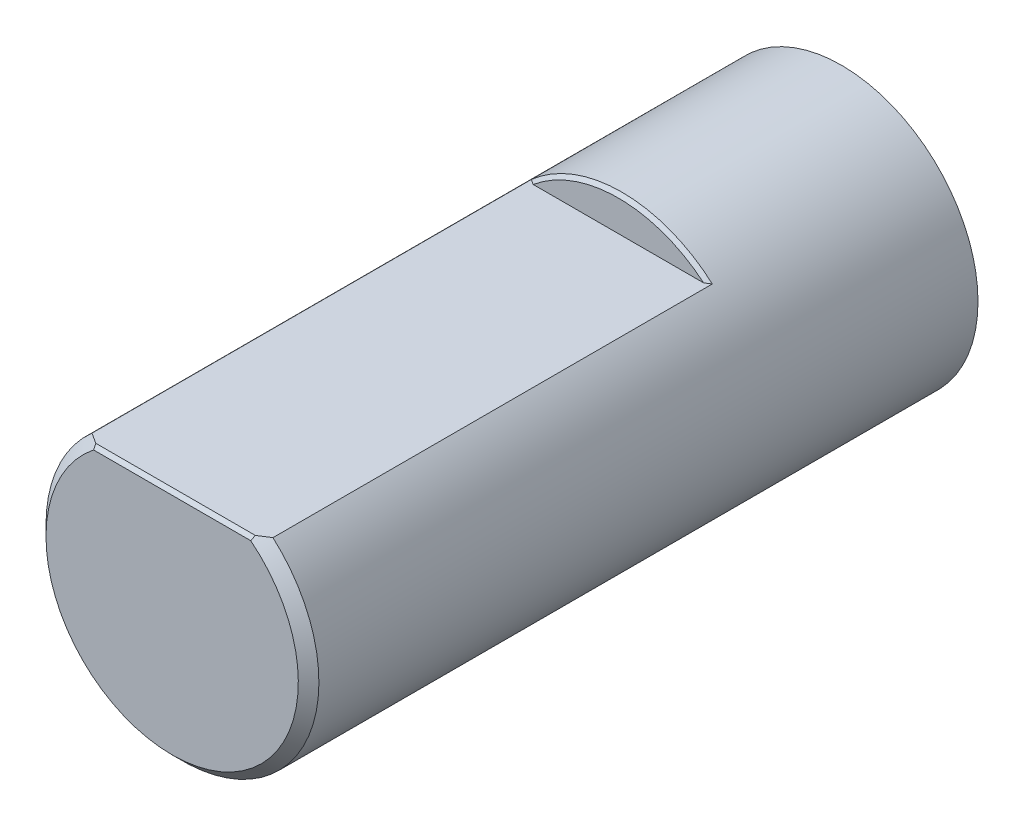
ISO-10303-21;
HEADER;
FILE_DESCRIPTION(('STEP AP214'),'2;1');
FILE_NAME('part.step','',(''),(''),'','','');
FILE_SCHEMA(('AUTOMOTIVE_DESIGN { 1 0 10303 214 1 1 1 1 }'));
ENDSEC;
DATA;
#1=APPLICATION_CONTEXT('core data for automotive mechanical design processes');
#2=APPLICATION_PROTOCOL_DEFINITION('international standard','automotive_design',2000,#1);
#3=PRODUCT_CONTEXT('',#1,'mechanical');
#4=PRODUCT('Part','Part','',(#3));
#5=PRODUCT_RELATED_PRODUCT_CATEGORY('part','',(#4));
#6=PRODUCT_DEFINITION_FORMATION('','',#4);
#7=PRODUCT_DEFINITION_CONTEXT('part definition',#1,'design');
#8=PRODUCT_DEFINITION('design','',#6,#7);
#9=PRODUCT_DEFINITION_SHAPE('','',#8);
#10=(LENGTH_UNIT() NAMED_UNIT(*) SI_UNIT(.MILLI.,.METRE.));
#11=(NAMED_UNIT(*) PLANE_ANGLE_UNIT() SI_UNIT($,.RADIAN.));
#12=(NAMED_UNIT(*) SI_UNIT($,.STERADIAN.) SOLID_ANGLE_UNIT());
#13=UNCERTAINTY_MEASURE_WITH_UNIT(LENGTH_MEASURE(1.E-05),#10,'distance_accuracy_value','');
#14=(GEOMETRIC_REPRESENTATION_CONTEXT(3) GLOBAL_UNCERTAINTY_ASSIGNED_CONTEXT((#13)) GLOBAL_UNIT_ASSIGNED_CONTEXT((#10,
#11,#12)) REPRESENTATION_CONTEXT('',''));
#15=CARTESIAN_POINT('',(0.,0.,0.));
#16=DIRECTION('',(0.,0.,1.));
#17=DIRECTION('',(1.,0.,0.));
#18=AXIS2_PLACEMENT_3D('',#15,#16,#17);
#19=CARTESIAN_POINT('',(0.,0.,6.5));
#20=DIRECTION('',(0.,0.,-1.));
#21=DIRECTION('',(-1.,0.,0.));
#22=AXIS2_PLACEMENT_3D('',#19,#20,#21);
#23=CYLINDRICAL_SURFACE('',#22,3.975);
#24=DIRECTION('',(0.,0.,-1.));
#25=VECTOR('',#24,1.);
#26=CARTESIAN_POINT('',(2.63628526529281,2.975,19.5));
#27=LINE('',#26,#25);
#28=CARTESIAN_POINT('',(2.63628526529281,2.975,19.2));
#29=VERTEX_POINT('',#28);
#30=CARTESIAN_POINT('',(2.63628526529281,2.975,6.40000000000001));
#31=VERTEX_POINT('',#30);
#32=EDGE_CURVE('E78',#29,#31,#27,.T.);
#33=ORIENTED_EDGE('',*,*,#32,.F.);
#34=CARTESIAN_POINT('',(0.,0.,19.2));
#35=DIRECTION('',(0.,0.,1.));
#36=DIRECTION('',(1.,0.,0.));
#37=AXIS2_PLACEMENT_3D('',#34,#35,#36);
#38=CIRCLE('',#37,3.975);
#39=CARTESIAN_POINT('',(-2.63628526529281,2.975,19.2));
#40=VERTEX_POINT('',#39);
#41=EDGE_CURVE('E11',#29,#40,#38,.F.);
#42=ORIENTED_EDGE('',*,*,#41,.T.);
#43=DIRECTION('',(0.,0.,-1.));
#44=VECTOR('',#43,1.);
#45=CARTESIAN_POINT('',(-2.63628526529281,2.975,19.5));
#46=LINE('',#45,#44);
#47=CARTESIAN_POINT('',(-2.63628526529281,2.975,6.40000000000001));
#48=VERTEX_POINT('',#47);
#49=EDGE_CURVE('E86',#40,#48,#46,.T.);
#50=ORIENTED_EDGE('',*,*,#49,.T.);
#51=CARTESIAN_POINT('',(0.,0.,6.40000000000001));
#52=DIRECTION('',(0.,0.,1.));
#53=DIRECTION('',(1.,0.,0.));
#54=AXIS2_PLACEMENT_3D('',#51,#52,#53);
#55=CIRCLE('',#54,3.975);
#56=EDGE_CURVE('E89',#48,#31,#55,.F.);
#57=ORIENTED_EDGE('',*,*,#56,.T.);
#58=EDGE_LOOP('',(#33,#42,#50,#57));
#59=FACE_BOUND('',#58,.T.);
#60=CARTESIAN_POINT('',(0.,0.,0.));
#61=DIRECTION('',(0.,0.,1.));
#62=DIRECTION('',(1.,0.,0.));
#63=AXIS2_PLACEMENT_3D('',#60,#61,#62);
#64=CIRCLE('',#63,3.975);
#65=CARTESIAN_POINT('',(3.975,0.,0.));
#66=VERTEX_POINT('',#65);
#67=EDGE_CURVE('E85',#66,#66,#64,.T.);
#68=ORIENTED_EDGE('',*,*,#67,.T.);
#69=EDGE_LOOP('',(#68));
#70=FACE_BOUND('',#69,.T.);
#71=ADVANCED_FACE('F35',(#59,#70),#23,.T.);
#72=CARTESIAN_POINT('',(0.,0.,6.5));
#73=DIRECTION('',(0.,0.,1.));
#74=DIRECTION('',(1.,0.,0.));
#75=AXIS2_PLACEMENT_3D('',#72,#73,#74);
#76=PLANE('',#75);
#77=DIRECTION('',(-1.,0.,0.));
#78=VECTOR('',#77,1.);
#79=CARTESIAN_POINT('',(0.,2.975,6.5));
#80=LINE('',#79,#78);
#81=CARTESIAN_POINT('',(2.48294180358704,2.975,6.5));
#82=VERTEX_POINT('',#81);
#83=CARTESIAN_POINT('',(-2.48294180358704,2.975,6.5));
#84=VERTEX_POINT('',#83);
#85=EDGE_CURVE('E167',#82,#84,#80,.T.);
#86=ORIENTED_EDGE('',*,*,#85,.F.);
#87=CARTESIAN_POINT('',(0.,0.,6.5));
#88=DIRECTION('',(0.,0.,1.));
#89=DIRECTION('',(1.,0.,0.));
#90=AXIS2_PLACEMENT_3D('',#87,#88,#89);
#91=CIRCLE('',#90,3.87500000000001);
#92=EDGE_CURVE('E99',#82,#84,#91,.T.);
#93=ORIENTED_EDGE('',*,*,#92,.T.);
#94=EDGE_LOOP('',(#86,#93));
#95=FACE_BOUND('',#94,.T.);
#96=ADVANCED_FACE('F166',(#95),#76,.T.);
#97=CARTESIAN_POINT('',(0.,0.,0.));
#98=DIRECTION('',(0.,0.,1.));
#99=DIRECTION('',(1.,0.,0.));
#100=AXIS2_PLACEMENT_3D('',#97,#98,#99);
#101=PLANE('',#100);
#102=ORIENTED_EDGE('',*,*,#67,.F.);
#103=EDGE_LOOP('',(#102));
#104=FACE_BOUND('',#103,.T.);
#105=ADVANCED_FACE('F171',(#104),#101,.F.);
#106=CARTESIAN_POINT('',(0.,2.975,19.5));
#107=DIRECTION('',(0.,-1.,0.));
#108=DIRECTION('',(0.,0.,-1.));
#109=AXIS2_PLACEMENT_3D('',#106,#107,#108);
#110=PLANE('',#109);
#111=DIRECTION('',(1.,0.,0.));
#112=VECTOR('',#111,1.);
#113=CARTESIAN_POINT('',(2.63628526529281,2.975,19.4));
#114=LINE('',#113,#112);
#115=CARTESIAN_POINT('',(-2.32379000772446,2.975,19.4));
#116=VERTEX_POINT('',#115);
#117=CARTESIAN_POINT('',(2.32379000772446,2.975,19.4));
#118=VERTEX_POINT('',#117);
#119=EDGE_CURVE('E93',#116,#118,#114,.T.);
#120=ORIENTED_EDGE('',*,*,#119,.T.);
#121=CARTESIAN_POINT('',(2.32379000772446,2.975,19.4));
#122=CARTESIAN_POINT('',(2.37643562231376,2.975,19.3675462415629));
#123=CARTESIAN_POINT('',(2.42879974849835,2.975,19.3346526641832));
#124=CARTESIAN_POINT('',(2.53296483228151,2.975,19.2679859942776));
#125=CARTESIAN_POINT('',(2.58476579195303,2.975,19.2342129049906));
#126=CARTESIAN_POINT('',(2.63628526529282,2.975,19.2));
#127=B_SPLINE_CURVE_WITH_KNOTS('',3,(#121,#122,#123,#124,#125,#126),.UNSPECIFIED.,.F.,.F.,(4,2,
4),(0.,0.185515234671433,0.371029786245917),.UNSPECIFIED.);
#128=EDGE_CURVE('E44',#118,#29,#127,.T.);
#129=ORIENTED_EDGE('',*,*,#128,.T.);
#130=ORIENTED_EDGE('',*,*,#32,.T.);
#131=CARTESIAN_POINT('',(2.63628526529281,2.975,6.40000000000001));
#132=CARTESIAN_POINT('',(2.61085931103459,2.975,6.41686797927617));
#133=CARTESIAN_POINT('',(2.58536771463501,2.975,6.4336353006206));
#134=CARTESIAN_POINT('',(2.53425322745164,2.975,6.4669686340335));
#135=CARTESIAN_POINT('',(2.50863033661597,2.975,6.4835346460224));
#136=CARTESIAN_POINT('',(2.48294180358704,2.975,6.5));
#137=B_SPLINE_CURVE_WITH_KNOTS('',3,(#131,#132,#133,#134,#135,#136),.UNSPECIFIED.,.F.,.F.,(4,2,
4),(0.,0.0915351351591234,0.183070306497465),.UNSPECIFIED.);
#138=EDGE_CURVE('E83',#31,#82,#137,.T.);
#139=ORIENTED_EDGE('',*,*,#138,.T.);
#140=ORIENTED_EDGE('',*,*,#85,.T.);
#141=CARTESIAN_POINT('',(-2.48294180358704,2.975,6.5));
#142=CARTESIAN_POINT('',(-2.50863033661597,2.975,6.4835346460224));
#143=CARTESIAN_POINT('',(-2.53425322745164,2.975,6.4669686340335));
#144=CARTESIAN_POINT('',(-2.58536771463501,2.975,6.4336353006206));
#145=CARTESIAN_POINT('',(-2.61085931103459,2.975,6.41686797927616));
#146=CARTESIAN_POINT('',(-2.63628526529281,2.975,6.40000000000001));
#147=B_SPLINE_CURVE_WITH_KNOTS('',3,(#141,#142,#143,#144,#145,#146),.UNSPECIFIED.,.F.,.F.,(4,2,
4),(0.,0.0915351713383423,0.183070306497467),.UNSPECIFIED.);
#148=EDGE_CURVE('E101',#84,#48,#147,.T.);
#149=ORIENTED_EDGE('',*,*,#148,.T.);
#150=ORIENTED_EDGE('',*,*,#49,.F.);
#151=CARTESIAN_POINT('',(-2.63628526529281,2.975,19.2));
#152=CARTESIAN_POINT('',(-2.58476579195302,2.975,19.2342129049906));
#153=CARTESIAN_POINT('',(-2.53296483228151,2.975,19.2679859942776));
#154=CARTESIAN_POINT('',(-2.42879974849836,2.975,19.3346526641832));
#155=CARTESIAN_POINT('',(-2.37643562231376,2.975,19.3675462415629));
#156=CARTESIAN_POINT('',(-2.32379000772447,2.975,19.4));
#157=B_SPLINE_CURVE_WITH_KNOTS('',3,(#151,#152,#153,#154,#155,#156),.UNSPECIFIED.,.F.,.F.,(4,2,
4),(0.,0.185514551574484,0.371029786245917),.UNSPECIFIED.);
#158=EDGE_CURVE('E144',#40,#116,#157,.T.);
#159=ORIENTED_EDGE('',*,*,#158,.T.);
#160=EDGE_LOOP('',(#120,#129,#130,#139,#140,#149,#150,#159));
#161=FACE_BOUND('',#160,.T.);
#162=ADVANCED_FACE('F80',(#161),#110,.F.);
#163=CARTESIAN_POINT('',(0.,0.,19.5));
#164=DIRECTION('',(0.,0.,1.));
#165=DIRECTION('',(1.,0.,0.));
#166=AXIS2_PLACEMENT_3D('',#163,#164,#165);
#167=PLANE('',#166);
#168=DIRECTION('',(-1.,0.,0.));
#169=VECTOR('',#168,1.);
#170=CARTESIAN_POINT('',(-2.63628526529281,2.875,19.5));
#171=LINE('',#170,#169);
#172=CARTESIAN_POINT('',(2.28910462845193,2.875,19.5));
#173=VERTEX_POINT('',#172);
#174=CARTESIAN_POINT('',(-2.28910462845193,2.875,19.5));
#175=VERTEX_POINT('',#174);
#176=EDGE_CURVE('E94',#173,#175,#171,.T.);
#177=ORIENTED_EDGE('',*,*,#176,.T.);
#178=CARTESIAN_POINT('',(0.,0.,19.5));
#179=DIRECTION('',(0.,0.,1.));
#180=DIRECTION('',(1.,0.,0.));
#181=AXIS2_PLACEMENT_3D('',#178,#179,#180);
#182=CIRCLE('',#181,3.675);
#183=EDGE_CURVE('E100',#175,#173,#182,.T.);
#184=ORIENTED_EDGE('',*,*,#183,.T.);
#185=EDGE_LOOP('',(#177,#184));
#186=FACE_BOUND('',#185,.T.);
#187=ADVANCED_FACE('F129',(#186),#167,.T.);
#188=CARTESIAN_POINT('',(0.,2.875,19.5));
#189=DIRECTION('',(0.,0.707106781186548,0.707106781186548));
#190=DIRECTION('',(1.,0.,0.));
#191=AXIS2_PLACEMENT_3D('',#188,#189,#190);
#192=PLANE('',#191);
#193=ORIENTED_EDGE('',*,*,#176,.F.);
#194=CARTESIAN_POINT('',(2.28910462845193,2.875,19.5));
#195=CARTESIAN_POINT('',(2.29492652640447,2.8916595560993,19.4833404439007));
#196=CARTESIAN_POINT('',(2.3007279236826,2.90832266756694,19.4666773324331));
#197=CARTESIAN_POINT('',(2.31228971677261,2.94165600090042,19.4333439990996));
#198=CARTESIAN_POINT('',(2.31805011258533,2.95832622276611,19.4166737772339));
#199=CARTESIAN_POINT('',(2.32379000772446,2.975,19.4));
#200=B_SPLINE_CURVE_WITH_KNOTS('',3,(#194,#195,#196,#197,#198,#199),.UNSPECIFIED.,.F.,.F.,(4,2,
4),(0.,0.0728064076953636,0.145612813912105),.UNSPECIFIED.);
#201=EDGE_CURVE('E138',#173,#118,#200,.T.);
#202=ORIENTED_EDGE('',*,*,#201,.T.);
#203=ORIENTED_EDGE('',*,*,#119,.F.);
#204=CARTESIAN_POINT('',(-2.32379000772446,2.975,19.4));
#205=CARTESIAN_POINT('',(-2.31805011258533,2.95832622276611,19.4166737772339));
#206=CARTESIAN_POINT('',(-2.31228971677261,2.94165600090042,19.4333439990996));
#207=CARTESIAN_POINT('',(-2.3007279236826,2.90832266756694,19.4666773324331));
#208=CARTESIAN_POINT('',(-2.29492652640448,2.8916595560993,19.4833404439007));
#209=CARTESIAN_POINT('',(-2.28910462845193,2.875,19.5));
#210=B_SPLINE_CURVE_WITH_KNOTS('',3,(#204,#205,#206,#207,#208,#209),.UNSPECIFIED.,.F.,.F.,(4,2,
4),(0.,0.0728064062167424,0.145612813912106),.UNSPECIFIED.);
#211=EDGE_CURVE('E104',#116,#175,#210,.T.);
#212=ORIENTED_EDGE('',*,*,#211,.T.);
#213=EDGE_LOOP('',(#193,#202,#203,#212));
#214=FACE_BOUND('',#213,.T.);
#215=ADVANCED_FACE('F124',(#214),#192,.T.);
#216=CARTESIAN_POINT('',(0.,0.,6.5));
#217=DIRECTION('',(0.,0.,-1.));
#218=DIRECTION('',(-1.,0.,0.));
#219=AXIS2_PLACEMENT_3D('',#216,#217,#218);
#220=CONICAL_SURFACE('',#219,3.87500000000001,0.785398163397448);
#221=ORIENTED_EDGE('',*,*,#138,.F.);
#222=ORIENTED_EDGE('',*,*,#56,.F.);
#223=ORIENTED_EDGE('',*,*,#148,.F.);
#224=ORIENTED_EDGE('',*,*,#92,.F.);
#225=EDGE_LOOP('',(#221,#222,#223,#224));
#226=FACE_BOUND('',#225,.T.);
#227=ADVANCED_FACE('F97',(#226),#220,.T.);
#228=CARTESIAN_POINT('',(0.,0.,19.5));
#229=DIRECTION('',(0.,0.,-1.));
#230=DIRECTION('',(-1.,0.,0.));
#231=AXIS2_PLACEMENT_3D('',#228,#229,#230);
#232=CONICAL_SURFACE('',#231,3.675,0.785398163397446);
#233=ORIENTED_EDGE('',*,*,#158,.F.);
#234=ORIENTED_EDGE('',*,*,#41,.F.);
#235=ORIENTED_EDGE('',*,*,#128,.F.);
#236=ORIENTED_EDGE('',*,*,#201,.F.);
#237=ORIENTED_EDGE('',*,*,#183,.F.);
#238=ORIENTED_EDGE('',*,*,#211,.F.);
#239=EDGE_LOOP('',(#233,#234,#235,#236,#237,#238));
#240=FACE_BOUND('',#239,.T.);
#241=ADVANCED_FACE('F37',(#240),#232,.T.);
#242=CLOSED_SHELL('',(#71,#96,#105,#162,#187,#215,#227,#241));
#243=MANIFOLD_SOLID_BREP('B2',#242);
#244=ADVANCED_BREP_SHAPE_REPRESENTATION('',(#18,#243),#14);
#245=SHAPE_DEFINITION_REPRESENTATION(#9,#244);
ENDSEC;
END-ISO-10303-21;
